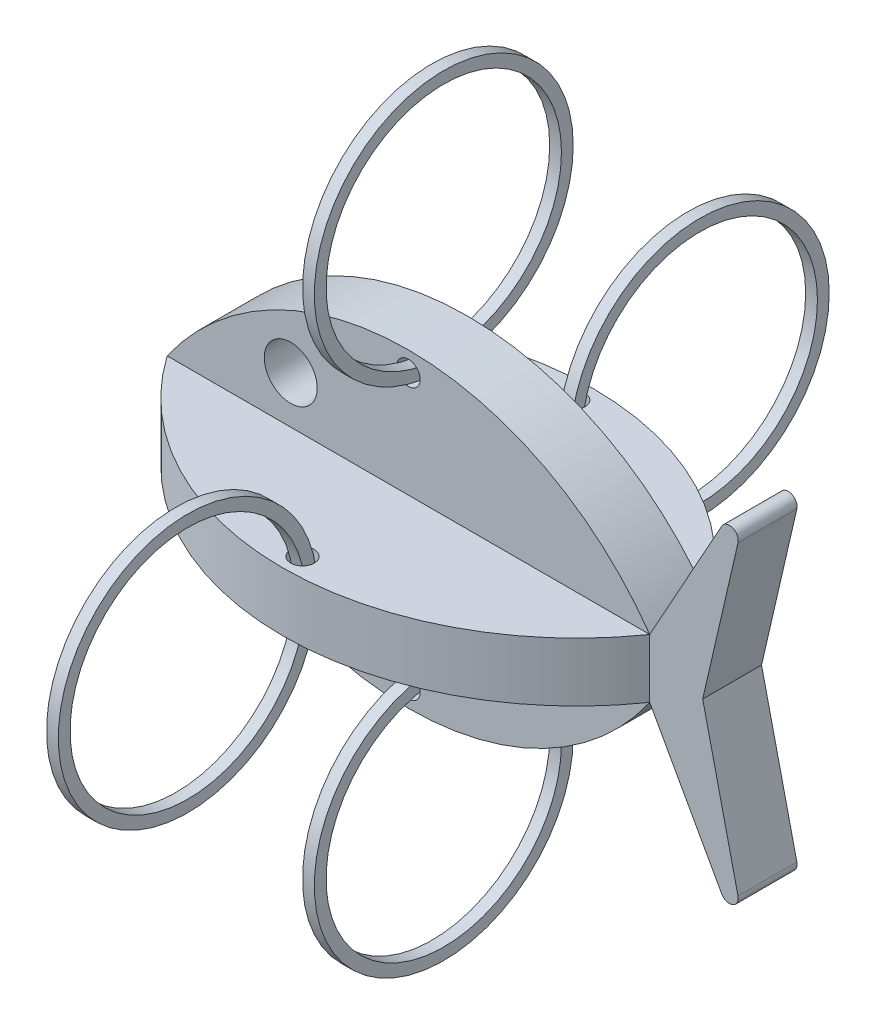
ISO-10303-21;
HEADER;
FILE_DESCRIPTION(('STEP AP214'),'2;1');
FILE_NAME('part.step','',(''),(''),'','','');
FILE_SCHEMA(('AUTOMOTIVE_DESIGN { 1 0 10303 214 1 1 1 1 }'));
ENDSEC;
DATA;
#1=APPLICATION_CONTEXT('core data for automotive mechanical design processes');
#2=APPLICATION_PROTOCOL_DEFINITION('international standard','automotive_design',2000,#1);
#3=PRODUCT_CONTEXT('',#1,'mechanical');
#4=PRODUCT('Part','Part','',(#3));
#5=PRODUCT_RELATED_PRODUCT_CATEGORY('part','',(#4));
#6=PRODUCT_DEFINITION_FORMATION('','',#4);
#7=PRODUCT_DEFINITION_CONTEXT('part definition',#1,'design');
#8=PRODUCT_DEFINITION('design','',#6,#7);
#9=PRODUCT_DEFINITION_SHAPE('','',#8);
#10=(LENGTH_UNIT() NAMED_UNIT(*) SI_UNIT(.MILLI.,.METRE.));
#11=(NAMED_UNIT(*) PLANE_ANGLE_UNIT() SI_UNIT($,.RADIAN.));
#12=(NAMED_UNIT(*) SI_UNIT($,.STERADIAN.) SOLID_ANGLE_UNIT());
#13=UNCERTAINTY_MEASURE_WITH_UNIT(LENGTH_MEASURE(1.E-05),#10,'distance_accuracy_value','');
#14=(GEOMETRIC_REPRESENTATION_CONTEXT(3) GLOBAL_UNCERTAINTY_ASSIGNED_CONTEXT((#13)) GLOBAL_UNIT_ASSIGNED_CONTEXT((#10,
#11,#12)) REPRESENTATION_CONTEXT('',''));
#15=CARTESIAN_POINT('',(0.,0.,0.));
#16=DIRECTION('',(0.,0.,1.));
#17=DIRECTION('',(1.,0.,0.));
#18=AXIS2_PLACEMENT_3D('',#15,#16,#17);
#19=CARTESIAN_POINT('',(41.,43.5,0.));
#20=DIRECTION('',(1.,0.,0.));
#21=DIRECTION('',(0.,0.,-1.));
#22=AXIS2_PLACEMENT_3D('',#19,#20,#21);
#23=CYLINDRICAL_SURFACE('',#22,20.);
#24=CARTESIAN_POINT('',(42.,43.5,0.));
#25=DIRECTION('',(1.,0.,0.));
#26=DIRECTION('',(0.,0.,-1.));
#27=AXIS2_PLACEMENT_3D('',#24,#25,#26);
#28=CIRCLE('',#27,20.);
#29=CARTESIAN_POINT('',(42.,43.5,-20.));
#30=VERTEX_POINT('',#29);
#31=EDGE_CURVE('P0_E18',#30,#30,#28,.F.);
#32=ORIENTED_EDGE('',*,*,#31,.F.);
#33=EDGE_LOOP('',(#32));
#34=FACE_BOUND('',#33,.T.);
#35=CARTESIAN_POINT('',(40.,43.5,0.));
#36=DIRECTION('',(1.,0.,0.));
#37=DIRECTION('',(0.,0.,-1.));
#38=AXIS2_PLACEMENT_3D('',#35,#36,#37);
#39=CIRCLE('',#38,20.);
#40=CARTESIAN_POINT('',(40.,43.5,-20.));
#41=VERTEX_POINT('',#40);
#42=EDGE_CURVE('P0_E27',#41,#41,#39,.T.);
#43=ORIENTED_EDGE('',*,*,#42,.F.);
#44=EDGE_LOOP('',(#43));
#45=FACE_BOUND('',#44,.T.);
#46=ADVANCED_FACE('P0_F15',(#34,#45),#23,.F.);
#47=CARTESIAN_POINT('',(42.,23.5,0.));
#48=DIRECTION('',(1.,0.,0.));
#49=DIRECTION('',(0.,0.,-1.));
#50=AXIS2_PLACEMENT_3D('',#47,#48,#49);
#51=PLANE('',#50);
#52=ORIENTED_EDGE('',*,*,#31,.T.);
#53=EDGE_LOOP('',(#52));
#54=FACE_BOUND('',#53,.T.);
#55=CARTESIAN_POINT('',(42.,43.5,0.));
#56=DIRECTION('',(1.,0.,0.));
#57=DIRECTION('',(0.,0.,-1.));
#58=AXIS2_PLACEMENT_3D('',#55,#56,#57);
#59=CIRCLE('',#58,22.);
#60=CARTESIAN_POINT('',(42.,43.5,-22.));
#61=VERTEX_POINT('',#60);
#62=EDGE_CURVE('P0_E22',#61,#61,#59,.F.);
#63=ORIENTED_EDGE('',*,*,#62,.F.);
#64=EDGE_LOOP('',(#63));
#65=FACE_BOUND('',#64,.T.);
#66=ADVANCED_FACE('P0_F35',(#54,#65),#51,.T.);
#67=CARTESIAN_POINT('',(40.,21.5,0.));
#68=DIRECTION('',(-1.,0.,0.));
#69=DIRECTION('',(0.,0.,1.));
#70=AXIS2_PLACEMENT_3D('',#67,#68,#69);
#71=PLANE('',#70);
#72=ORIENTED_EDGE('',*,*,#42,.T.);
#73=EDGE_LOOP('',(#72));
#74=FACE_BOUND('',#73,.T.);
#75=CARTESIAN_POINT('',(40.,43.5,0.));
#76=DIRECTION('',(1.,0.,0.));
#77=DIRECTION('',(0.,0.,-1.));
#78=AXIS2_PLACEMENT_3D('',#75,#76,#77);
#79=CIRCLE('',#78,22.);
#80=CARTESIAN_POINT('',(40.,43.5,-22.));
#81=VERTEX_POINT('',#80);
#82=EDGE_CURVE('P0_E10',#81,#81,#79,.T.);
#83=ORIENTED_EDGE('',*,*,#82,.F.);
#84=EDGE_LOOP('',(#83));
#85=FACE_BOUND('',#84,.T.);
#86=ADVANCED_FACE('P0_F44',(#74,#85),#71,.T.);
#87=CARTESIAN_POINT('',(41.,43.5,0.));
#88=DIRECTION('',(1.,0.,0.));
#89=DIRECTION('',(0.,0.,-1.));
#90=AXIS2_PLACEMENT_3D('',#87,#88,#89);
#91=CYLINDRICAL_SURFACE('',#90,22.);
#92=ORIENTED_EDGE('',*,*,#82,.T.);
#93=EDGE_LOOP('',(#92));
#94=FACE_BOUND('',#93,.T.);
#95=ORIENTED_EDGE('',*,*,#62,.T.);
#96=EDGE_LOOP('',(#95));
#97=FACE_BOUND('',#96,.T.);
#98=ADVANCED_FACE('P0_F45',(#94,#97),#91,.T.);
#99=CLOSED_SHELL('',(#46,#66,#86,#98));
#100=MANIFOLD_SOLID_BREP('P0_B1',#99);
#101=CARTESIAN_POINT('',(41.,-43.5,0.));
#102=DIRECTION('',(1.,0.,0.));
#103=DIRECTION('',(0.,0.,-1.));
#104=AXIS2_PLACEMENT_3D('',#101,#102,#103);
#105=CYLINDRICAL_SURFACE('',#104,20.);
#106=CARTESIAN_POINT('',(42.,-43.5,0.));
#107=DIRECTION('',(1.,0.,0.));
#108=DIRECTION('',(0.,0.,-1.));
#109=AXIS2_PLACEMENT_3D('',#106,#107,#108);
#110=CIRCLE('',#109,20.);
#111=CARTESIAN_POINT('',(42.,-43.5,-20.));
#112=VERTEX_POINT('',#111);
#113=EDGE_CURVE('P1_E18',#112,#112,#110,.F.);
#114=ORIENTED_EDGE('',*,*,#113,.F.);
#115=EDGE_LOOP('',(#114));
#116=FACE_BOUND('',#115,.T.);
#117=CARTESIAN_POINT('',(40.,-43.5,0.));
#118=DIRECTION('',(1.,0.,0.));
#119=DIRECTION('',(0.,0.,-1.));
#120=AXIS2_PLACEMENT_3D('',#117,#118,#119);
#121=CIRCLE('',#120,20.);
#122=CARTESIAN_POINT('',(40.,-43.5,-20.));
#123=VERTEX_POINT('',#122);
#124=EDGE_CURVE('P1_E27',#123,#123,#121,.T.);
#125=ORIENTED_EDGE('',*,*,#124,.F.);
#126=EDGE_LOOP('',(#125));
#127=FACE_BOUND('',#126,.T.);
#128=ADVANCED_FACE('P1_F15',(#116,#127),#105,.F.);
#129=CARTESIAN_POINT('',(42.,-23.5,0.));
#130=DIRECTION('',(1.,0.,0.));
#131=DIRECTION('',(0.,0.,-1.));
#132=AXIS2_PLACEMENT_3D('',#129,#130,#131);
#133=PLANE('',#132);
#134=ORIENTED_EDGE('',*,*,#113,.T.);
#135=EDGE_LOOP('',(#134));
#136=FACE_BOUND('',#135,.T.);
#137=CARTESIAN_POINT('',(42.,-43.5,0.));
#138=DIRECTION('',(1.,0.,0.));
#139=DIRECTION('',(0.,0.,-1.));
#140=AXIS2_PLACEMENT_3D('',#137,#138,#139);
#141=CIRCLE('',#140,22.);
#142=CARTESIAN_POINT('',(42.,-43.5,-22.));
#143=VERTEX_POINT('',#142);
#144=EDGE_CURVE('P1_E22',#143,#143,#141,.F.);
#145=ORIENTED_EDGE('',*,*,#144,.F.);
#146=EDGE_LOOP('',(#145));
#147=FACE_BOUND('',#146,.T.);
#148=ADVANCED_FACE('P1_F35',(#136,#147),#133,.T.);
#149=CARTESIAN_POINT('',(40.,-21.5,0.));
#150=DIRECTION('',(-1.,0.,0.));
#151=DIRECTION('',(0.,0.,1.));
#152=AXIS2_PLACEMENT_3D('',#149,#150,#151);
#153=PLANE('',#152);
#154=ORIENTED_EDGE('',*,*,#124,.T.);
#155=EDGE_LOOP('',(#154));
#156=FACE_BOUND('',#155,.T.);
#157=CARTESIAN_POINT('',(40.,-43.5,0.));
#158=DIRECTION('',(1.,0.,0.));
#159=DIRECTION('',(0.,0.,-1.));
#160=AXIS2_PLACEMENT_3D('',#157,#158,#159);
#161=CIRCLE('',#160,22.);
#162=CARTESIAN_POINT('',(40.,-43.5,-22.));
#163=VERTEX_POINT('',#162);
#164=EDGE_CURVE('P1_E10',#163,#163,#161,.T.);
#165=ORIENTED_EDGE('',*,*,#164,.F.);
#166=EDGE_LOOP('',(#165));
#167=FACE_BOUND('',#166,.T.);
#168=ADVANCED_FACE('P1_F44',(#156,#167),#153,.T.);
#169=CARTESIAN_POINT('',(41.,-43.5,0.));
#170=DIRECTION('',(1.,0.,0.));
#171=DIRECTION('',(0.,0.,-1.));
#172=AXIS2_PLACEMENT_3D('',#169,#170,#171);
#173=CYLINDRICAL_SURFACE('',#172,22.);
#174=ORIENTED_EDGE('',*,*,#164,.T.);
#175=EDGE_LOOP('',(#174));
#176=FACE_BOUND('',#175,.T.);
#177=ORIENTED_EDGE('',*,*,#144,.T.);
#178=EDGE_LOOP('',(#177));
#179=FACE_BOUND('',#178,.T.);
#180=ADVANCED_FACE('P1_F45',(#176,#179),#173,.T.);
#181=CLOSED_SHELL('',(#128,#148,#168,#180));
#182=MANIFOLD_SOLID_BREP('P1_B1',#181);
#183=CARTESIAN_POINT('',(41.,0.,-43.5));
#184=DIRECTION('',(1.,0.,0.));
#185=DIRECTION('',(0.,0.,-1.));
#186=AXIS2_PLACEMENT_3D('',#183,#184,#185);
#187=CYLINDRICAL_SURFACE('',#186,20.);
#188=CARTESIAN_POINT('',(42.,0.,-43.5));
#189=DIRECTION('',(1.,0.,0.));
#190=DIRECTION('',(0.,0.,-1.));
#191=AXIS2_PLACEMENT_3D('',#188,#189,#190);
#192=CIRCLE('',#191,20.);
#193=CARTESIAN_POINT('',(42.,0.,-63.5));
#194=VERTEX_POINT('',#193);
#195=EDGE_CURVE('P2_E18',#194,#194,#192,.F.);
#196=ORIENTED_EDGE('',*,*,#195,.F.);
#197=EDGE_LOOP('',(#196));
#198=FACE_BOUND('',#197,.T.);
#199=CARTESIAN_POINT('',(40.,0.,-43.5));
#200=DIRECTION('',(1.,0.,0.));
#201=DIRECTION('',(0.,0.,-1.));
#202=AXIS2_PLACEMENT_3D('',#199,#200,#201);
#203=CIRCLE('',#202,20.);
#204=CARTESIAN_POINT('',(40.,0.,-63.5));
#205=VERTEX_POINT('',#204);
#206=EDGE_CURVE('P2_E27',#205,#205,#203,.T.);
#207=ORIENTED_EDGE('',*,*,#206,.F.);
#208=EDGE_LOOP('',(#207));
#209=FACE_BOUND('',#208,.T.);
#210=ADVANCED_FACE('P2_F15',(#198,#209),#187,.F.);
#211=CARTESIAN_POINT('',(42.,0.,-23.5));
#212=DIRECTION('',(1.,0.,0.));
#213=DIRECTION('',(0.,0.,-1.));
#214=AXIS2_PLACEMENT_3D('',#211,#212,#213);
#215=PLANE('',#214);
#216=ORIENTED_EDGE('',*,*,#195,.T.);
#217=EDGE_LOOP('',(#216));
#218=FACE_BOUND('',#217,.T.);
#219=CARTESIAN_POINT('',(42.,0.,-43.5));
#220=DIRECTION('',(1.,0.,0.));
#221=DIRECTION('',(0.,0.,-1.));
#222=AXIS2_PLACEMENT_3D('',#219,#220,#221);
#223=CIRCLE('',#222,22.);
#224=CARTESIAN_POINT('',(42.,0.,-65.5));
#225=VERTEX_POINT('',#224);
#226=EDGE_CURVE('P2_E22',#225,#225,#223,.F.);
#227=ORIENTED_EDGE('',*,*,#226,.F.);
#228=EDGE_LOOP('',(#227));
#229=FACE_BOUND('',#228,.T.);
#230=ADVANCED_FACE('P2_F35',(#218,#229),#215,.T.);
#231=CARTESIAN_POINT('',(40.,0.,-21.5));
#232=DIRECTION('',(-1.,0.,0.));
#233=DIRECTION('',(0.,0.,1.));
#234=AXIS2_PLACEMENT_3D('',#231,#232,#233);
#235=PLANE('',#234);
#236=ORIENTED_EDGE('',*,*,#206,.T.);
#237=EDGE_LOOP('',(#236));
#238=FACE_BOUND('',#237,.T.);
#239=CARTESIAN_POINT('',(40.,0.,-43.5));
#240=DIRECTION('',(1.,0.,0.));
#241=DIRECTION('',(0.,0.,-1.));
#242=AXIS2_PLACEMENT_3D('',#239,#240,#241);
#243=CIRCLE('',#242,22.);
#244=CARTESIAN_POINT('',(40.,0.,-65.5));
#245=VERTEX_POINT('',#244);
#246=EDGE_CURVE('P2_E10',#245,#245,#243,.T.);
#247=ORIENTED_EDGE('',*,*,#246,.F.);
#248=EDGE_LOOP('',(#247));
#249=FACE_BOUND('',#248,.T.);
#250=ADVANCED_FACE('P2_F44',(#238,#249),#235,.T.);
#251=CARTESIAN_POINT('',(41.,0.,-43.5));
#252=DIRECTION('',(1.,0.,0.));
#253=DIRECTION('',(0.,0.,-1.));
#254=AXIS2_PLACEMENT_3D('',#251,#252,#253);
#255=CYLINDRICAL_SURFACE('',#254,22.);
#256=ORIENTED_EDGE('',*,*,#246,.T.);
#257=EDGE_LOOP('',(#256));
#258=FACE_BOUND('',#257,.T.);
#259=ORIENTED_EDGE('',*,*,#226,.T.);
#260=EDGE_LOOP('',(#259));
#261=FACE_BOUND('',#260,.T.);
#262=ADVANCED_FACE('P2_F45',(#258,#261),#255,.T.);
#263=CLOSED_SHELL('',(#210,#230,#250,#262));
#264=MANIFOLD_SOLID_BREP('P2_B1',#263);
#265=CARTESIAN_POINT('',(41.,0.,43.5));
#266=DIRECTION('',(1.,0.,0.));
#267=DIRECTION('',(0.,0.,-1.));
#268=AXIS2_PLACEMENT_3D('',#265,#266,#267);
#269=CYLINDRICAL_SURFACE('',#268,20.);
#270=CARTESIAN_POINT('',(42.,0.,43.5));
#271=DIRECTION('',(1.,0.,0.));
#272=DIRECTION('',(0.,0.,-1.));
#273=AXIS2_PLACEMENT_3D('',#270,#271,#272);
#274=CIRCLE('',#273,20.);
#275=CARTESIAN_POINT('',(42.,0.,23.5));
#276=VERTEX_POINT('',#275);
#277=EDGE_CURVE('P3_E18',#276,#276,#274,.F.);
#278=ORIENTED_EDGE('',*,*,#277,.F.);
#279=EDGE_LOOP('',(#278));
#280=FACE_BOUND('',#279,.T.);
#281=CARTESIAN_POINT('',(40.,0.,43.5));
#282=DIRECTION('',(1.,0.,0.));
#283=DIRECTION('',(0.,0.,-1.));
#284=AXIS2_PLACEMENT_3D('',#281,#282,#283);
#285=CIRCLE('',#284,20.);
#286=CARTESIAN_POINT('',(40.,0.,23.5));
#287=VERTEX_POINT('',#286);
#288=EDGE_CURVE('P3_E27',#287,#287,#285,.T.);
#289=ORIENTED_EDGE('',*,*,#288,.F.);
#290=EDGE_LOOP('',(#289));
#291=FACE_BOUND('',#290,.T.);
#292=ADVANCED_FACE('P3_F15',(#280,#291),#269,.F.);
#293=CARTESIAN_POINT('',(42.,0.,23.5));
#294=DIRECTION('',(1.,0.,0.));
#295=DIRECTION('',(0.,0.,-1.));
#296=AXIS2_PLACEMENT_3D('',#293,#294,#295);
#297=PLANE('',#296);
#298=ORIENTED_EDGE('',*,*,#277,.T.);
#299=EDGE_LOOP('',(#298));
#300=FACE_BOUND('',#299,.T.);
#301=CARTESIAN_POINT('',(42.,0.,43.5));
#302=DIRECTION('',(1.,0.,0.));
#303=DIRECTION('',(0.,0.,-1.));
#304=AXIS2_PLACEMENT_3D('',#301,#302,#303);
#305=CIRCLE('',#304,22.);
#306=CARTESIAN_POINT('',(42.,0.,21.5));
#307=VERTEX_POINT('',#306);
#308=EDGE_CURVE('P3_E22',#307,#307,#305,.F.);
#309=ORIENTED_EDGE('',*,*,#308,.F.);
#310=EDGE_LOOP('',(#309));
#311=FACE_BOUND('',#310,.T.);
#312=ADVANCED_FACE('P3_F35',(#300,#311),#297,.T.);
#313=CARTESIAN_POINT('',(40.,0.,21.5));
#314=DIRECTION('',(-1.,0.,0.));
#315=DIRECTION('',(0.,0.,1.));
#316=AXIS2_PLACEMENT_3D('',#313,#314,#315);
#317=PLANE('',#316);
#318=ORIENTED_EDGE('',*,*,#288,.T.);
#319=EDGE_LOOP('',(#318));
#320=FACE_BOUND('',#319,.T.);
#321=CARTESIAN_POINT('',(40.,0.,43.5));
#322=DIRECTION('',(1.,0.,0.));
#323=DIRECTION('',(0.,0.,-1.));
#324=AXIS2_PLACEMENT_3D('',#321,#322,#323);
#325=CIRCLE('',#324,22.);
#326=CARTESIAN_POINT('',(40.,0.,21.5));
#327=VERTEX_POINT('',#326);
#328=EDGE_CURVE('P3_E10',#327,#327,#325,.T.);
#329=ORIENTED_EDGE('',*,*,#328,.F.);
#330=EDGE_LOOP('',(#329));
#331=FACE_BOUND('',#330,.T.);
#332=ADVANCED_FACE('P3_F44',(#320,#331),#317,.T.);
#333=CARTESIAN_POINT('',(41.,0.,43.5));
#334=DIRECTION('',(1.,0.,0.));
#335=DIRECTION('',(0.,0.,-1.));
#336=AXIS2_PLACEMENT_3D('',#333,#334,#335);
#337=CYLINDRICAL_SURFACE('',#336,22.);
#338=ORIENTED_EDGE('',*,*,#328,.T.);
#339=EDGE_LOOP('',(#338));
#340=FACE_BOUND('',#339,.T.);
#341=ORIENTED_EDGE('',*,*,#308,.T.);
#342=EDGE_LOOP('',(#341));
#343=FACE_BOUND('',#342,.T.);
#344=ADVANCED_FACE('P3_F45',(#340,#343),#337,.T.);
#345=CLOSED_SHELL('',(#292,#312,#332,#344));
#346=MANIFOLD_SOLID_BREP('P3_B1',#345);
#347=CARTESIAN_POINT('',(41.,0.,23.));
#348=DIRECTION('',(0.,-1.,0.));
#349=DIRECTION('',(0.,0.,-1.));
#350=AXIS2_PLACEMENT_3D('',#347,#348,#349);
#351=CYLINDRICAL_SURFACE('',#350,2.);
#352=CARTESIAN_POINT('',(41.,5.00000000000001,23.));
#353=DIRECTION('',(0.,-1.,0.));
#354=DIRECTION('',(0.,0.,-1.));
#355=AXIS2_PLACEMENT_3D('',#352,#353,#354);
#356=CIRCLE('',#355,2.);
#357=CARTESIAN_POINT('',(41.,5.00000000000001,21.));
#358=VERTEX_POINT('',#357);
#359=EDGE_CURVE('P4_E141',#358,#358,#356,.T.);
#360=ORIENTED_EDGE('',*,*,#359,.F.);
#361=EDGE_LOOP('',(#360));
#362=FACE_BOUND('',#361,.T.);
#363=CARTESIAN_POINT('',(41.,-4.99999999999999,23.));
#364=DIRECTION('',(0.,-1.,0.));
#365=DIRECTION('',(0.,0.,-1.));
#366=AXIS2_PLACEMENT_3D('',#363,#364,#365);
#367=CIRCLE('',#366,2.);
#368=CARTESIAN_POINT('',(41.,-4.99999999999999,21.));
#369=VERTEX_POINT('',#368);
#370=EDGE_CURVE('P4_E20',#369,#369,#367,.T.);
#371=ORIENTED_EDGE('',*,*,#370,.T.);
#372=EDGE_LOOP('',(#371));
#373=FACE_BOUND('',#372,.T.);
#374=ADVANCED_FACE('P4_F17',(#362,#373),#351,.F.);
#375=CARTESIAN_POINT('',(54.3636838274954,-9.95952887576336,5.));
#376=DIRECTION('',(0.,0.,-1.));
#377=DIRECTION('',(0.,1.,0.));
#378=AXIS2_PLACEMENT_3D('',#375,#376,#377);
#379=PLANE('',#378);
#380=CARTESIAN_POINT('',(41.,-23.,5.));
#381=DIRECTION('',(0.,0.,-1.));
#382=DIRECTION('',(0.,1.,0.));
#383=AXIS2_PLACEMENT_3D('',#380,#381,#382);
#384=CIRCLE('',#383,2.);
#385=CARTESIAN_POINT('',(41.,-21.,5.));
#386=VERTEX_POINT('',#385);
#387=EDGE_CURVE('P4_E136',#386,#386,#384,.T.);
#388=ORIENTED_EDGE('',*,*,#387,.T.);
#389=EDGE_LOOP('',(#388));
#390=FACE_BOUND('',#389,.T.);
#391=CARTESIAN_POINT('',(21.,-13.,5.));
#392=DIRECTION('',(0.,0.,-1.));
#393=DIRECTION('',(0.,1.,0.));
#394=AXIS2_PLACEMENT_3D('',#391,#392,#393);
#395=CIRCLE('',#394,4.5);
#396=CARTESIAN_POINT('',(21.,-8.5,5.));
#397=VERTEX_POINT('',#396);
#398=EDGE_CURVE('P4_E139',#397,#397,#395,.T.);
#399=ORIENTED_EDGE('',*,*,#398,.T.);
#400=EDGE_LOOP('',(#399));
#401=FACE_BOUND('',#400,.T.);
#402=CARTESIAN_POINT('',(41.,23.6181760425083,5.));
#403=DIRECTION('',(0.,0.,-1.));
#404=DIRECTION('',(0.,1.,0.));
#405=AXIS2_PLACEMENT_3D('',#402,#403,#404);
#406=CIRCLE('',#405,50.);
#407=CARTESIAN_POINT('',(82.,-5.00000000000005,5.));
#408=VERTEX_POINT('',#407);
#409=CARTESIAN_POINT('',(0.,-5.00000000000004,5.));
#410=VERTEX_POINT('',#409);
#411=EDGE_CURVE('P4_E82',#408,#410,#406,.T.);
#412=ORIENTED_EDGE('',*,*,#411,.F.);
#413=DIRECTION('',(1.,0.,0.));
#414=VECTOR('',#413,1.);
#415=CARTESIAN_POINT('',(54.3636838274954,-5.,5.));
#416=LINE('',#415,#414);
#417=EDGE_CURVE('P4_E85',#408,#410,#416,.F.);
#418=ORIENTED_EDGE('',*,*,#417,.T.);
#419=EDGE_LOOP('',(#412,#418));
#420=FACE_BOUND('',#419,.T.);
#421=ADVANCED_FACE('P4_F84',(#390,#401,#420),#379,.F.);
#422=CARTESIAN_POINT('',(54.3636838274954,-5.,-9.95952887576336));
#423=DIRECTION('',(0.,1.,0.));
#424=DIRECTION('',(0.,0.,1.));
#425=AXIS2_PLACEMENT_3D('',#422,#423,#424);
#426=PLANE('',#425);
#427=ORIENTED_EDGE('',*,*,#370,.F.);
#428=EDGE_LOOP('',(#427));
#429=FACE_BOUND('',#428,.T.);
#430=CARTESIAN_POINT('',(41.,-5.00000000000001,-23.6181760425084));
#431=DIRECTION('',(0.,-1.,0.));
#432=DIRECTION('',(0.,0.,-1.));
#433=AXIS2_PLACEMENT_3D('',#430,#431,#432);
#434=CIRCLE('',#433,50.);
#435=EDGE_CURVE('P4_E90',#410,#408,#434,.F.);
#436=ORIENTED_EDGE('',*,*,#435,.F.);
#437=ORIENTED_EDGE('',*,*,#417,.F.);
#438=EDGE_LOOP('',(#436,#437));
#439=FACE_BOUND('',#438,.T.);
#440=ADVANCED_FACE('P4_F95',(#429,#439),#426,.F.);
#441=CARTESIAN_POINT('',(54.3636838274954,5.,-9.95952887576336));
#442=DIRECTION('',(0.,1.,0.));
#443=DIRECTION('',(0.,0.,1.));
#444=AXIS2_PLACEMENT_3D('',#441,#442,#443);
#445=PLANE('',#444);
#446=ORIENTED_EDGE('',*,*,#359,.T.);
#447=EDGE_LOOP('',(#446));
#448=FACE_BOUND('',#447,.T.);
#449=DIRECTION('',(1.,0.,0.));
#450=VECTOR('',#449,1.);
#451=CARTESIAN_POINT('',(54.3636838274954,4.99999999999997,5.));
#452=LINE('',#451,#450);
#453=CARTESIAN_POINT('',(82.,5.,5.));
#454=VERTEX_POINT('',#453);
#455=CARTESIAN_POINT('',(0.,4.99999999999998,4.99999999999999));
#456=VERTEX_POINT('',#455);
#457=EDGE_CURVE('P4_E91',#454,#456,#452,.F.);
#458=ORIENTED_EDGE('',*,*,#457,.T.);
#459=CARTESIAN_POINT('',(41.,4.99999999999996,-23.6181760425084));
#460=DIRECTION('',(0.,-1.,0.));
#461=DIRECTION('',(0.,0.,-1.));
#462=AXIS2_PLACEMENT_3D('',#459,#460,#461);
#463=CIRCLE('',#462,50.);
#464=EDGE_CURVE('P4_E113',#454,#456,#463,.T.);
#465=ORIENTED_EDGE('',*,*,#464,.F.);
#466=EDGE_LOOP('',(#458,#465));
#467=FACE_BOUND('',#466,.T.);
#468=ADVANCED_FACE('P4_F150',(#448,#467),#445,.T.);
#469=CARTESIAN_POINT('',(54.3636838274954,-9.95952887576336,5.));
#470=DIRECTION('',(0.,0.,-1.));
#471=DIRECTION('',(0.,1.,0.));
#472=AXIS2_PLACEMENT_3D('',#469,#470,#471);
#473=PLANE('',#472);
#474=DIRECTION('',(0.484872195156442,-0.874585018373956,0.));
#475=VECTOR('',#474,1.);
#476=CARTESIAN_POINT('',(94.2265673752612,-27.0535901199555,5.));
#477=LINE('',#476,#475);
#478=CARTESIAN_POINT('',(94.2265673752612,-27.0535901199555,5.));
#479=VERTEX_POINT('',#478);
#480=EDGE_CURVE('P4_E106',#479,#408,#477,.F.);
#481=ORIENTED_EDGE('',*,*,#480,.F.);
#482=CARTESIAN_POINT('',(95.5384449028222,-26.3262818272209,5.));
#483=DIRECTION('',(0.,0.,-1.));
#484=DIRECTION('',(0.,1.,0.));
#485=AXIS2_PLACEMENT_3D('',#482,#483,#484);
#486=CIRCLE('',#485,1.5);
#487=CARTESIAN_POINT('',(97.,-25.9888552457051,5.));
#488=VERTEX_POINT('',#487);
#489=EDGE_CURVE('P4_E126',#488,#479,#486,.T.);
#490=ORIENTED_EDGE('',*,*,#489,.F.);
#491=DIRECTION('',(-0.224951054343865,0.974370064785235,0.));
#492=VECTOR('',#491,1.);
#493=CARTESIAN_POINT('',(91.,0.,5.));
#494=LINE('',#493,#492);
#495=CARTESIAN_POINT('',(91.,0.,5.));
#496=VERTEX_POINT('',#495);
#497=EDGE_CURVE('P4_E390',#496,#488,#494,.F.);
#498=ORIENTED_EDGE('',*,*,#497,.F.);
#499=DIRECTION('',(-0.224951054343866,-0.974370064785235,0.));
#500=VECTOR('',#499,1.);
#501=CARTESIAN_POINT('',(91.,0.,5.));
#502=LINE('',#501,#500);
#503=CARTESIAN_POINT('',(97.,25.988855245705,5.));
#504=VERTEX_POINT('',#503);
#505=EDGE_CURVE('P4_E374',#496,#504,#502,.F.);
#506=ORIENTED_EDGE('',*,*,#505,.T.);
#507=CARTESIAN_POINT('',(95.5384449028222,26.3262818272208,5.));
#508=DIRECTION('',(0.,0.,1.));
#509=DIRECTION('',(0.,-1.,0.));
#510=AXIS2_PLACEMENT_3D('',#507,#508,#509);
#511=CIRCLE('',#510,1.5);
#512=CARTESIAN_POINT('',(94.2265673752612,27.0535901199555,5.));
#513=VERTEX_POINT('',#512);
#514=EDGE_CURVE('P4_E372',#513,#504,#511,.F.);
#515=ORIENTED_EDGE('',*,*,#514,.F.);
#516=DIRECTION('',(0.484872195156442,0.874585018373956,0.));
#517=VECTOR('',#516,1.);
#518=CARTESIAN_POINT('',(94.2265673752612,27.0535901199555,5.));
#519=LINE('',#518,#517);
#520=EDGE_CURVE('P4_E109',#513,#454,#519,.F.);
#521=ORIENTED_EDGE('',*,*,#520,.T.);
#522=DIRECTION('',(0.,-1.,0.));
#523=VECTOR('',#522,1.);
#524=CARTESIAN_POINT('',(82.,0.,4.99999999999999));
#525=LINE('',#524,#523);
#526=EDGE_CURVE('P4_E102',#408,#454,#525,.F.);
#527=ORIENTED_EDGE('',*,*,#526,.F.);
#528=EDGE_LOOP('',(#481,#490,#498,#506,#515,#521,#527));
#529=FACE_BOUND('',#528,.T.);
#530=ADVANCED_FACE('P4_F104',(#529),#473,.F.);
#531=CARTESIAN_POINT('',(21.,-13.,0.));
#532=DIRECTION('',(0.,0.,-1.));
#533=DIRECTION('',(0.,1.,0.));
#534=AXIS2_PLACEMENT_3D('',#531,#532,#533);
#535=CYLINDRICAL_SURFACE('',#534,4.5);
#536=CARTESIAN_POINT('',(21.,-13.,-5.));
#537=DIRECTION('',(0.,0.,-1.));
#538=DIRECTION('',(0.,1.,0.));
#539=AXIS2_PLACEMENT_3D('',#536,#537,#538);
#540=CIRCLE('',#539,4.5);
#541=CARTESIAN_POINT('',(21.,-8.5,-5.));
#542=VERTEX_POINT('',#541);
#543=EDGE_CURVE('P4_E359',#542,#542,#540,.F.);
#544=ORIENTED_EDGE('',*,*,#543,.F.);
#545=EDGE_LOOP('',(#544));
#546=FACE_BOUND('',#545,.T.);
#547=ORIENTED_EDGE('',*,*,#398,.F.);
#548=EDGE_LOOP('',(#547));
#549=FACE_BOUND('',#548,.T.);
#550=ADVANCED_FACE('P4_F239',(#546,#549),#535,.F.);
#551=CARTESIAN_POINT('',(41.,-23.,0.));
#552=DIRECTION('',(0.,0.,-1.));
#553=DIRECTION('',(0.,1.,0.));
#554=AXIS2_PLACEMENT_3D('',#551,#552,#553);
#555=CYLINDRICAL_SURFACE('',#554,2.);
#556=CARTESIAN_POINT('',(41.,-23.,-5.));
#557=DIRECTION('',(0.,0.,-1.));
#558=DIRECTION('',(0.,1.,0.));
#559=AXIS2_PLACEMENT_3D('',#556,#557,#558);
#560=CIRCLE('',#559,2.);
#561=CARTESIAN_POINT('',(41.,-21.,-5.));
#562=VERTEX_POINT('',#561);
#563=EDGE_CURVE('P4_E363',#562,#562,#560,.F.);
#564=ORIENTED_EDGE('',*,*,#563,.F.);
#565=EDGE_LOOP('',(#564));
#566=FACE_BOUND('',#565,.T.);
#567=ORIENTED_EDGE('',*,*,#387,.F.);
#568=EDGE_LOOP('',(#567));
#569=FACE_BOUND('',#568,.T.);
#570=ADVANCED_FACE('P4_F235',(#566,#569),#555,.F.);
#571=CARTESIAN_POINT('',(54.3636838274954,-9.95952887576336,5.));
#572=DIRECTION('',(0.,0.,-1.));
#573=DIRECTION('',(0.,1.,0.));
#574=AXIS2_PLACEMENT_3D('',#571,#572,#573);
#575=PLANE('',#574);
#576=CARTESIAN_POINT('',(41.,23.,5.));
#577=DIRECTION('',(0.,0.,1.));
#578=DIRECTION('',(0.,-1.,0.));
#579=AXIS2_PLACEMENT_3D('',#576,#577,#578);
#580=CIRCLE('',#579,2.);
#581=CARTESIAN_POINT('',(41.,21.,5.));
#582=VERTEX_POINT('',#581);
#583=EDGE_CURVE('P4_E427',#582,#582,#580,.F.);
#584=ORIENTED_EDGE('',*,*,#583,.T.);
#585=EDGE_LOOP('',(#584));
#586=FACE_BOUND('',#585,.T.);
#587=CARTESIAN_POINT('',(21.,13.,5.));
#588=DIRECTION('',(0.,0.,1.));
#589=DIRECTION('',(0.,-1.,0.));
#590=AXIS2_PLACEMENT_3D('',#587,#588,#589);
#591=CIRCLE('',#590,4.5);
#592=CARTESIAN_POINT('',(21.,8.5,5.));
#593=VERTEX_POINT('',#592);
#594=EDGE_CURVE('P4_E430',#593,#593,#591,.F.);
#595=ORIENTED_EDGE('',*,*,#594,.T.);
#596=EDGE_LOOP('',(#595));
#597=FACE_BOUND('',#596,.T.);
#598=CARTESIAN_POINT('',(41.,-23.6181760425084,5.));
#599=DIRECTION('',(0.,0.,1.));
#600=DIRECTION('',(0.,-1.,0.));
#601=AXIS2_PLACEMENT_3D('',#598,#599,#600);
#602=CIRCLE('',#601,50.);
#603=EDGE_CURVE('P4_E366',#456,#454,#602,.F.);
#604=ORIENTED_EDGE('',*,*,#603,.F.);
#605=ORIENTED_EDGE('',*,*,#457,.F.);
#606=EDGE_LOOP('',(#604,#605));
#607=FACE_BOUND('',#606,.T.);
#608=ADVANCED_FACE('P4_F232',(#586,#597,#607),#575,.F.);
#609=CARTESIAN_POINT('',(41.,23.6181760425083,0.));
#610=DIRECTION('',(0.,0.,-1.));
#611=DIRECTION('',(0.,1.,0.));
#612=AXIS2_PLACEMENT_3D('',#609,#610,#611);
#613=CYLINDRICAL_SURFACE('',#612,50.);
#614=DIRECTION('',(0.,0.,1.));
#615=VECTOR('',#614,1.);
#616=CARTESIAN_POINT('',(82.,-5.00000000000003,0.));
#617=LINE('',#616,#615);
#618=CARTESIAN_POINT('',(82.,-5.00000000000006,-5.00000000000005));
#619=VERTEX_POINT('',#618);
#620=EDGE_CURVE('P4_E119',#408,#619,#617,.F.);
#621=ORIENTED_EDGE('',*,*,#620,.F.);
#622=ORIENTED_EDGE('',*,*,#411,.T.);
#623=DIRECTION('',(0.,0.,1.));
#624=VECTOR('',#623,1.);
#625=CARTESIAN_POINT('',(0.,-5.,0.));
#626=LINE('',#625,#624);
#627=CARTESIAN_POINT('',(0.,-5.00000000000001,-5.00000000000004));
#628=VERTEX_POINT('',#627);
#629=EDGE_CURVE('P4_E388',#628,#410,#626,.T.);
#630=ORIENTED_EDGE('',*,*,#629,.F.);
#631=CARTESIAN_POINT('',(41.,23.6181760425083,-5.));
#632=DIRECTION('',(0.,0.,-1.));
#633=DIRECTION('',(0.,1.,0.));
#634=AXIS2_PLACEMENT_3D('',#631,#632,#633);
#635=CIRCLE('',#634,50.);
#636=EDGE_CURVE('P4_E122',#619,#628,#635,.T.);
#637=ORIENTED_EDGE('',*,*,#636,.F.);
#638=EDGE_LOOP('',(#621,#622,#630,#637));
#639=FACE_BOUND('',#638,.T.);
#640=ADVANCED_FACE('P4_F124',(#639),#613,.T.);
#641=CARTESIAN_POINT('',(41.,0.,-23.6181760425084));
#642=DIRECTION('',(0.,-1.,0.));
#643=DIRECTION('',(0.,0.,-1.));
#644=AXIS2_PLACEMENT_3D('',#641,#642,#643);
#645=CYLINDRICAL_SURFACE('',#644,50.);
#646=ORIENTED_EDGE('',*,*,#526,.T.);
#647=ORIENTED_EDGE('',*,*,#464,.T.);
#648=DIRECTION('',(0.,1.,0.));
#649=VECTOR('',#648,1.);
#650=CARTESIAN_POINT('',(0.,-5.,5.));
#651=LINE('',#650,#649);
#652=EDGE_CURVE('P4_E130',#410,#456,#651,.T.);
#653=ORIENTED_EDGE('',*,*,#652,.F.);
#654=ORIENTED_EDGE('',*,*,#435,.T.);
#655=EDGE_LOOP('',(#646,#647,#653,#654));
#656=FACE_BOUND('',#655,.T.);
#657=ADVANCED_FACE('P4_F128',(#656),#645,.T.);
#658=CARTESIAN_POINT('',(94.2265673752612,27.0535901199555,0.));
#659=DIRECTION('',(0.874585018373956,-0.484872195156442,0.));
#660=DIRECTION('',(0.484872195156442,0.874585018373956,0.));
#661=AXIS2_PLACEMENT_3D('',#658,#659,#660);
#662=PLANE('',#661);
#663=ORIENTED_EDGE('',*,*,#520,.F.);
#664=DIRECTION('',(0.,0.,1.));
#665=VECTOR('',#664,1.);
#666=CARTESIAN_POINT('',(94.2265673752613,27.0535901199555,0.));
#667=LINE('',#666,#665);
#668=CARTESIAN_POINT('',(94.2265673752612,27.0535901199555,-5.));
#669=VERTEX_POINT('',#668);
#670=EDGE_CURVE('P4_E375',#669,#513,#667,.T.);
#671=ORIENTED_EDGE('',*,*,#670,.F.);
#672=DIRECTION('',(0.484872195156441,0.874585018373957,0.));
#673=VECTOR('',#672,1.);
#674=CARTESIAN_POINT('',(82.,4.99999999999997,-5.));
#675=LINE('',#674,#673);
#676=CARTESIAN_POINT('',(82.,4.99999999999998,-5.00000000000001));
#677=VERTEX_POINT('',#676);
#678=EDGE_CURVE('P4_E35',#677,#669,#675,.T.);
#679=ORIENTED_EDGE('',*,*,#678,.F.);
#680=DIRECTION('',(0.,0.,1.));
#681=VECTOR('',#680,1.);
#682=CARTESIAN_POINT('',(82.,4.99999999999998,0.));
#683=LINE('',#682,#681);
#684=EDGE_CURVE('P4_E432',#454,#677,#683,.F.);
#685=ORIENTED_EDGE('',*,*,#684,.F.);
#686=EDGE_LOOP('',(#663,#671,#679,#685));
#687=FACE_BOUND('',#686,.T.);
#688=ADVANCED_FACE('P4_F224',(#687),#662,.F.);
#689=CARTESIAN_POINT('',(95.5384449028222,26.3262818272208,0.));
#690=DIRECTION('',(0.,0.,1.));
#691=DIRECTION('',(0.,-1.,0.));
#692=AXIS2_PLACEMENT_3D('',#689,#690,#691);
#693=CYLINDRICAL_SURFACE('',#692,1.5);
#694=DIRECTION('',(0.,0.,1.));
#695=VECTOR('',#694,1.);
#696=CARTESIAN_POINT('',(97.,25.9888552457049,0.));
#697=LINE('',#696,#695);
#698=CARTESIAN_POINT('',(97.,25.988855245705,-5.));
#699=VERTEX_POINT('',#698);
#700=EDGE_CURVE('P4_E378',#504,#699,#697,.F.);
#701=ORIENTED_EDGE('',*,*,#700,.T.);
#702=CARTESIAN_POINT('',(95.5384449028222,26.3262818272208,-5.));
#703=DIRECTION('',(0.,0.,1.));
#704=DIRECTION('',(0.,-1.,0.));
#705=AXIS2_PLACEMENT_3D('',#702,#703,#704);
#706=CIRCLE('',#705,1.5);
#707=EDGE_CURVE('P4_E423',#669,#699,#706,.F.);
#708=ORIENTED_EDGE('',*,*,#707,.F.);
#709=ORIENTED_EDGE('',*,*,#670,.T.);
#710=ORIENTED_EDGE('',*,*,#514,.T.);
#711=EDGE_LOOP('',(#701,#708,#709,#710));
#712=FACE_BOUND('',#711,.T.);
#713=ADVANCED_FACE('P4_F220',(#712),#693,.T.);
#714=CARTESIAN_POINT('',(91.,0.,0.));
#715=DIRECTION('',(-0.974370064785235,0.224951054343866,0.));
#716=DIRECTION('',(-0.224951054343866,-0.974370064785235,0.));
#717=AXIS2_PLACEMENT_3D('',#714,#715,#716);
#718=PLANE('',#717);
#719=ORIENTED_EDGE('',*,*,#505,.F.);
#720=DIRECTION('',(0.,0.,1.));
#721=VECTOR('',#720,1.);
#722=CARTESIAN_POINT('',(91.,0.,0.));
#723=LINE('',#722,#721);
#724=CARTESIAN_POINT('',(91.,0.,-5.));
#725=VERTEX_POINT('',#724);
#726=EDGE_CURVE('P4_E392',#725,#496,#723,.T.);
#727=ORIENTED_EDGE('',*,*,#726,.F.);
#728=DIRECTION('',(-0.224951054343865,-0.974370064785235,0.));
#729=VECTOR('',#728,1.);
#730=CARTESIAN_POINT('',(97.,25.9888552457049,-5.));
#731=LINE('',#730,#729);
#732=EDGE_CURVE('P4_E426',#699,#725,#731,.T.);
#733=ORIENTED_EDGE('',*,*,#732,.F.);
#734=ORIENTED_EDGE('',*,*,#700,.F.);
#735=EDGE_LOOP('',(#719,#727,#733,#734));
#736=FACE_BOUND('',#735,.T.);
#737=ADVANCED_FACE('P4_F216',(#736),#718,.F.);
#738=CARTESIAN_POINT('',(91.,0.,0.));
#739=DIRECTION('',(0.974370064785235,0.224951054343865,0.));
#740=DIRECTION('',(-0.224951054343865,0.974370064785235,0.));
#741=AXIS2_PLACEMENT_3D('',#738,#739,#740);
#742=PLANE('',#741);
#743=ORIENTED_EDGE('',*,*,#726,.T.);
#744=ORIENTED_EDGE('',*,*,#497,.T.);
#745=DIRECTION('',(0.,0.,-1.));
#746=VECTOR('',#745,1.);
#747=CARTESIAN_POINT('',(97.,-25.988855245705,0.));
#748=LINE('',#747,#746);
#749=CARTESIAN_POINT('',(97.,-25.9888552457051,-5.));
#750=VERTEX_POINT('',#749);
#751=EDGE_CURVE('P4_E371',#750,#488,#748,.F.);
#752=ORIENTED_EDGE('',*,*,#751,.F.);
#753=DIRECTION('',(0.224951054343865,-0.974370064785235,0.));
#754=VECTOR('',#753,1.);
#755=CARTESIAN_POINT('',(91.,0.,-5.));
#756=LINE('',#755,#754);
#757=EDGE_CURVE('P4_E422',#725,#750,#756,.T.);
#758=ORIENTED_EDGE('',*,*,#757,.F.);
#759=EDGE_LOOP('',(#743,#744,#752,#758));
#760=FACE_BOUND('',#759,.T.);
#761=ADVANCED_FACE('P4_F212',(#760),#742,.T.);
#762=CARTESIAN_POINT('',(95.5384449028222,-26.3262818272209,0.));
#763=DIRECTION('',(0.,0.,-1.));
#764=DIRECTION('',(0.,1.,0.));
#765=AXIS2_PLACEMENT_3D('',#762,#763,#764);
#766=CYLINDRICAL_SURFACE('',#765,1.5);
#767=ORIENTED_EDGE('',*,*,#751,.T.);
#768=ORIENTED_EDGE('',*,*,#489,.T.);
#769=DIRECTION('',(0.,0.,1.));
#770=VECTOR('',#769,1.);
#771=CARTESIAN_POINT('',(94.2265673752612,-27.0535901199555,0.));
#772=LINE('',#771,#770);
#773=CARTESIAN_POINT('',(94.2265673752612,-27.0535901199555,-5.));
#774=VERTEX_POINT('',#773);
#775=EDGE_CURVE('P4_E121',#774,#479,#772,.T.);
#776=ORIENTED_EDGE('',*,*,#775,.F.);
#777=CARTESIAN_POINT('',(95.5384449028222,-26.3262818272209,-5.));
#778=DIRECTION('',(0.,0.,-1.));
#779=DIRECTION('',(0.,1.,0.));
#780=AXIS2_PLACEMENT_3D('',#777,#778,#779);
#781=CIRCLE('',#780,1.5);
#782=EDGE_CURVE('P4_E418',#750,#774,#781,.T.);
#783=ORIENTED_EDGE('',*,*,#782,.F.);
#784=EDGE_LOOP('',(#767,#768,#776,#783));
#785=FACE_BOUND('',#784,.T.);
#786=ADVANCED_FACE('P4_F209',(#785),#766,.T.);
#787=CARTESIAN_POINT('',(94.2265673752612,-27.0535901199555,0.));
#788=DIRECTION('',(-0.874585018373956,-0.484872195156442,0.));
#789=DIRECTION('',(0.484872195156442,-0.874585018373956,0.));
#790=AXIS2_PLACEMENT_3D('',#787,#788,#789);
#791=PLANE('',#790);
#792=ORIENTED_EDGE('',*,*,#775,.T.);
#793=ORIENTED_EDGE('',*,*,#480,.T.);
#794=ORIENTED_EDGE('',*,*,#620,.T.);
#795=DIRECTION('',(-0.484872195156442,0.874585018373956,0.));
#796=VECTOR('',#795,1.);
#797=CARTESIAN_POINT('',(94.2265673752612,-27.0535901199555,-5.));
#798=LINE('',#797,#796);
#799=EDGE_CURVE('P4_E421',#774,#619,#798,.T.);
#800=ORIENTED_EDGE('',*,*,#799,.F.);
#801=EDGE_LOOP('',(#792,#793,#794,#800));
#802=FACE_BOUND('',#801,.T.);
#803=ADVANCED_FACE('P4_F117',(#802),#791,.T.);
#804=CARTESIAN_POINT('',(54.3636838274954,-9.95952887576336,-5.));
#805=DIRECTION('',(0.,0.,-1.));
#806=DIRECTION('',(0.,1.,0.));
#807=AXIS2_PLACEMENT_3D('',#804,#805,#806);
#808=PLANE('',#807);
#809=ORIENTED_EDGE('',*,*,#563,.T.);
#810=EDGE_LOOP('',(#809));
#811=FACE_BOUND('',#810,.T.);
#812=ORIENTED_EDGE('',*,*,#543,.T.);
#813=EDGE_LOOP('',(#812));
#814=FACE_BOUND('',#813,.T.);
#815=DIRECTION('',(1.,0.,0.));
#816=VECTOR('',#815,1.);
#817=CARTESIAN_POINT('',(54.3636838274954,-5.,-5.));
#818=LINE('',#817,#816);
#819=EDGE_CURVE('P4_E417',#628,#619,#818,.T.);
#820=ORIENTED_EDGE('',*,*,#819,.T.);
#821=ORIENTED_EDGE('',*,*,#636,.T.);
#822=EDGE_LOOP('',(#820,#821));
#823=FACE_BOUND('',#822,.T.);
#824=ADVANCED_FACE('P4_F202',(#811,#814,#823),#808,.T.);
#825=CARTESIAN_POINT('',(41.,-23.6181760425084,0.));
#826=DIRECTION('',(0.,0.,1.));
#827=DIRECTION('',(0.,-1.,0.));
#828=AXIS2_PLACEMENT_3D('',#825,#826,#827);
#829=CYLINDRICAL_SURFACE('',#828,50.);
#830=ORIENTED_EDGE('',*,*,#684,.T.);
#831=CARTESIAN_POINT('',(41.,-23.6181760425084,-5.));
#832=DIRECTION('',(0.,0.,1.));
#833=DIRECTION('',(0.,-1.,0.));
#834=AXIS2_PLACEMENT_3D('',#831,#832,#833);
#835=CIRCLE('',#834,50.);
#836=CARTESIAN_POINT('',(0.,5.,-5.00000000000004));
#837=VERTEX_POINT('',#836);
#838=EDGE_CURVE('P4_E414',#837,#677,#835,.F.);
#839=ORIENTED_EDGE('',*,*,#838,.F.);
#840=DIRECTION('',(0.,0.,1.));
#841=VECTOR('',#840,1.);
#842=CARTESIAN_POINT('',(0.,5.,0.));
#843=LINE('',#842,#841);
#844=EDGE_CURVE('P4_E387',#456,#837,#843,.F.);
#845=ORIENTED_EDGE('',*,*,#844,.F.);
#846=ORIENTED_EDGE('',*,*,#603,.T.);
#847=EDGE_LOOP('',(#830,#839,#845,#846));
#848=FACE_BOUND('',#847,.T.);
#849=ADVANCED_FACE('P4_F198',(#848),#829,.T.);
#850=CARTESIAN_POINT('',(21.,13.,0.));
#851=DIRECTION('',(0.,0.,1.));
#852=DIRECTION('',(0.,-1.,0.));
#853=AXIS2_PLACEMENT_3D('',#850,#851,#852);
#854=CYLINDRICAL_SURFACE('',#853,4.5);
#855=CARTESIAN_POINT('',(21.,13.,-5.));
#856=DIRECTION('',(0.,0.,1.));
#857=DIRECTION('',(0.,-1.,0.));
#858=AXIS2_PLACEMENT_3D('',#855,#856,#857);
#859=CIRCLE('',#858,4.5);
#860=CARTESIAN_POINT('',(21.,8.5,-5.));
#861=VERTEX_POINT('',#860);
#862=EDGE_CURVE('P4_E411',#861,#861,#859,.T.);
#863=ORIENTED_EDGE('',*,*,#862,.F.);
#864=EDGE_LOOP('',(#863));
#865=FACE_BOUND('',#864,.T.);
#866=ORIENTED_EDGE('',*,*,#594,.F.);
#867=EDGE_LOOP('',(#866));
#868=FACE_BOUND('',#867,.T.);
#869=ADVANCED_FACE('P4_F194',(#865,#868),#854,.F.);
#870=CARTESIAN_POINT('',(41.,23.,0.));
#871=DIRECTION('',(0.,0.,1.));
#872=DIRECTION('',(0.,-1.,0.));
#873=AXIS2_PLACEMENT_3D('',#870,#871,#872);
#874=CYLINDRICAL_SURFACE('',#873,2.);
#875=CARTESIAN_POINT('',(41.,23.,-5.));
#876=DIRECTION('',(0.,0.,1.));
#877=DIRECTION('',(0.,-1.,0.));
#878=AXIS2_PLACEMENT_3D('',#875,#876,#877);
#879=CIRCLE('',#878,2.);
#880=CARTESIAN_POINT('',(41.,21.,-5.));
#881=VERTEX_POINT('',#880);
#882=EDGE_CURVE('P4_E407',#881,#881,#879,.T.);
#883=ORIENTED_EDGE('',*,*,#882,.F.);
#884=EDGE_LOOP('',(#883));
#885=FACE_BOUND('',#884,.T.);
#886=ORIENTED_EDGE('',*,*,#583,.F.);
#887=EDGE_LOOP('',(#886));
#888=FACE_BOUND('',#887,.T.);
#889=ADVANCED_FACE('P4_F190',(#885,#888),#874,.F.);
#890=CARTESIAN_POINT('',(0.,-5.,0.));
#891=DIRECTION('',(-1.,0.,0.));
#892=DIRECTION('',(0.,0.,1.));
#893=AXIS2_PLACEMENT_3D('',#890,#891,#892);
#894=PLANE('',#893);
#895=ORIENTED_EDGE('',*,*,#652,.T.);
#896=ORIENTED_EDGE('',*,*,#844,.T.);
#897=DIRECTION('',(0.,1.,0.));
#898=VECTOR('',#897,1.);
#899=CARTESIAN_POINT('',(0.,0.,-5.00000000000005));
#900=LINE('',#899,#898);
#901=EDGE_CURVE('P4_E410',#628,#837,#900,.T.);
#902=ORIENTED_EDGE('',*,*,#901,.F.);
#903=ORIENTED_EDGE('',*,*,#629,.T.);
#904=EDGE_LOOP('',(#895,#896,#902,#903));
#905=FACE_BOUND('',#904,.T.);
#906=ADVANCED_FACE('P4_F186',(#905),#894,.T.);
#907=CARTESIAN_POINT('',(54.3636838274954,-9.95952887576336,-5.));
#908=DIRECTION('',(0.,0.,-1.));
#909=DIRECTION('',(0.,1.,0.));
#910=AXIS2_PLACEMENT_3D('',#907,#908,#909);
#911=PLANE('',#910);
#912=ORIENTED_EDGE('',*,*,#782,.T.);
#913=ORIENTED_EDGE('',*,*,#799,.T.);
#914=DIRECTION('',(0.,1.,0.));
#915=VECTOR('',#914,1.);
#916=CARTESIAN_POINT('',(82.,0.,-5.00000000000002));
#917=LINE('',#916,#915);
#918=EDGE_CURVE('P4_E406',#677,#619,#917,.F.);
#919=ORIENTED_EDGE('',*,*,#918,.F.);
#920=ORIENTED_EDGE('',*,*,#678,.T.);
#921=ORIENTED_EDGE('',*,*,#707,.T.);
#922=ORIENTED_EDGE('',*,*,#732,.T.);
#923=ORIENTED_EDGE('',*,*,#757,.T.);
#924=EDGE_LOOP('',(#912,#913,#919,#920,#921,#922,#923));
#925=FACE_BOUND('',#924,.T.);
#926=ADVANCED_FACE('P4_F182',(#925),#911,.T.);
#927=CARTESIAN_POINT('',(54.3636838274954,-5.,-9.95952887576336));
#928=DIRECTION('',(0.,1.,0.));
#929=DIRECTION('',(0.,0.,1.));
#930=AXIS2_PLACEMENT_3D('',#927,#928,#929);
#931=PLANE('',#930);
#932=CARTESIAN_POINT('',(41.,-5.00000000000001,-23.));
#933=DIRECTION('',(0.,1.,0.));
#934=DIRECTION('',(0.,0.,1.));
#935=AXIS2_PLACEMENT_3D('',#932,#933,#934);
#936=CIRCLE('',#935,2.);
#937=CARTESIAN_POINT('',(41.,-5.00000000000001,-21.));
#938=VERTEX_POINT('',#937);
#939=EDGE_CURVE('P4_E400',#938,#938,#936,.T.);
#940=ORIENTED_EDGE('',*,*,#939,.T.);
#941=EDGE_LOOP('',(#940));
#942=FACE_BOUND('',#941,.T.);
#943=CARTESIAN_POINT('',(41.,-5.00000000000002,23.6181760425083));
#944=DIRECTION('',(0.,1.,0.));
#945=DIRECTION('',(0.,0.,1.));
#946=AXIS2_PLACEMENT_3D('',#943,#944,#945);
#947=CIRCLE('',#946,50.);
#948=EDGE_CURVE('P4_E403',#619,#628,#947,.T.);
#949=ORIENTED_EDGE('',*,*,#948,.F.);
#950=ORIENTED_EDGE('',*,*,#819,.F.);
#951=EDGE_LOOP('',(#949,#950));
#952=FACE_BOUND('',#951,.T.);
#953=ADVANCED_FACE('P4_F178',(#942,#952),#931,.F.);
#954=CARTESIAN_POINT('',(54.3636838274954,-9.95952887576336,-5.));
#955=DIRECTION('',(0.,0.,-1.));
#956=DIRECTION('',(0.,1.,0.));
#957=AXIS2_PLACEMENT_3D('',#954,#955,#956);
#958=PLANE('',#957);
#959=ORIENTED_EDGE('',*,*,#882,.T.);
#960=EDGE_LOOP('',(#959));
#961=FACE_BOUND('',#960,.T.);
#962=ORIENTED_EDGE('',*,*,#862,.T.);
#963=EDGE_LOOP('',(#962));
#964=FACE_BOUND('',#963,.T.);
#965=DIRECTION('',(1.,0.,0.));
#966=VECTOR('',#965,1.);
#967=CARTESIAN_POINT('',(54.3636838274954,5.,-5.));
#968=LINE('',#967,#966);
#969=EDGE_CURVE('P4_E399',#837,#677,#968,.T.);
#970=ORIENTED_EDGE('',*,*,#969,.F.);
#971=ORIENTED_EDGE('',*,*,#838,.T.);
#972=EDGE_LOOP('',(#970,#971));
#973=FACE_BOUND('',#972,.T.);
#974=ADVANCED_FACE('P4_F174',(#961,#964,#973),#958,.T.);
#975=CARTESIAN_POINT('',(41.,0.,23.6181760425083));
#976=DIRECTION('',(0.,1.,0.));
#977=DIRECTION('',(0.,0.,1.));
#978=AXIS2_PLACEMENT_3D('',#975,#976,#977);
#979=CYLINDRICAL_SURFACE('',#978,50.);
#980=ORIENTED_EDGE('',*,*,#918,.T.);
#981=ORIENTED_EDGE('',*,*,#948,.T.);
#982=ORIENTED_EDGE('',*,*,#901,.T.);
#983=CARTESIAN_POINT('',(41.,5.00000000000001,23.6181760425083));
#984=DIRECTION('',(0.,1.,0.));
#985=DIRECTION('',(0.,0.,1.));
#986=AXIS2_PLACEMENT_3D('',#983,#984,#985);
#987=CIRCLE('',#986,50.);
#988=EDGE_CURVE('P4_E26',#677,#837,#987,.T.);
#989=ORIENTED_EDGE('',*,*,#988,.F.);
#990=EDGE_LOOP('',(#980,#981,#982,#989));
#991=FACE_BOUND('',#990,.T.);
#992=ADVANCED_FACE('P4_F167',(#991),#979,.T.);
#993=CARTESIAN_POINT('',(41.,0.,-23.));
#994=DIRECTION('',(0.,1.,0.));
#995=DIRECTION('',(0.,0.,1.));
#996=AXIS2_PLACEMENT_3D('',#993,#994,#995);
#997=CYLINDRICAL_SURFACE('',#996,2.);
#998=CARTESIAN_POINT('',(41.,4.99999999999999,-23.));
#999=DIRECTION('',(0.,1.,0.));
#1000=DIRECTION('',(0.,0.,1.));
#1001=AXIS2_PLACEMENT_3D('',#998,#999,#1000);
#1002=CIRCLE('',#1001,2.);
#1003=CARTESIAN_POINT('',(41.,4.99999999999999,-21.));
#1004=VERTEX_POINT('',#1003);
#1005=EDGE_CURVE('P4_E11',#1004,#1004,#1002,.F.);
#1006=ORIENTED_EDGE('',*,*,#1005,.F.);
#1007=EDGE_LOOP('',(#1006));
#1008=FACE_BOUND('',#1007,.T.);
#1009=ORIENTED_EDGE('',*,*,#939,.F.);
#1010=EDGE_LOOP('',(#1009));
#1011=FACE_BOUND('',#1010,.T.);
#1012=ADVANCED_FACE('P4_F161',(#1008,#1011),#997,.F.);
#1013=CARTESIAN_POINT('',(54.3636838274954,5.,-9.95952887576336));
#1014=DIRECTION('',(0.,1.,0.));
#1015=DIRECTION('',(0.,0.,1.));
#1016=AXIS2_PLACEMENT_3D('',#1013,#1014,#1015);
#1017=PLANE('',#1016);
#1018=ORIENTED_EDGE('',*,*,#1005,.T.);
#1019=EDGE_LOOP('',(#1018));
#1020=FACE_BOUND('',#1019,.T.);
#1021=ORIENTED_EDGE('',*,*,#969,.T.);
#1022=ORIENTED_EDGE('',*,*,#988,.T.);
#1023=EDGE_LOOP('',(#1021,#1022));
#1024=FACE_BOUND('',#1023,.T.);
#1025=ADVANCED_FACE('P4_F159',(#1020,#1024),#1017,.T.);
#1026=CLOSED_SHELL('',(#374,#421,#440,#468,#530,#550,#570,#608,#640,#657,#688,#713,#737,#761,
#786,#803,#824,#849,#869,#889,#906,#926,#953,#974,#992,#1012,#1025));
#1027=MANIFOLD_SOLID_BREP('P4_B1',#1026);
#1028=ADVANCED_BREP_SHAPE_REPRESENTATION('',(#18,#100,#182,#264,#346,#1027),#14);
#1029=SHAPE_DEFINITION_REPRESENTATION(#9,#1028);
ENDSEC;
END-ISO-10303-21;
